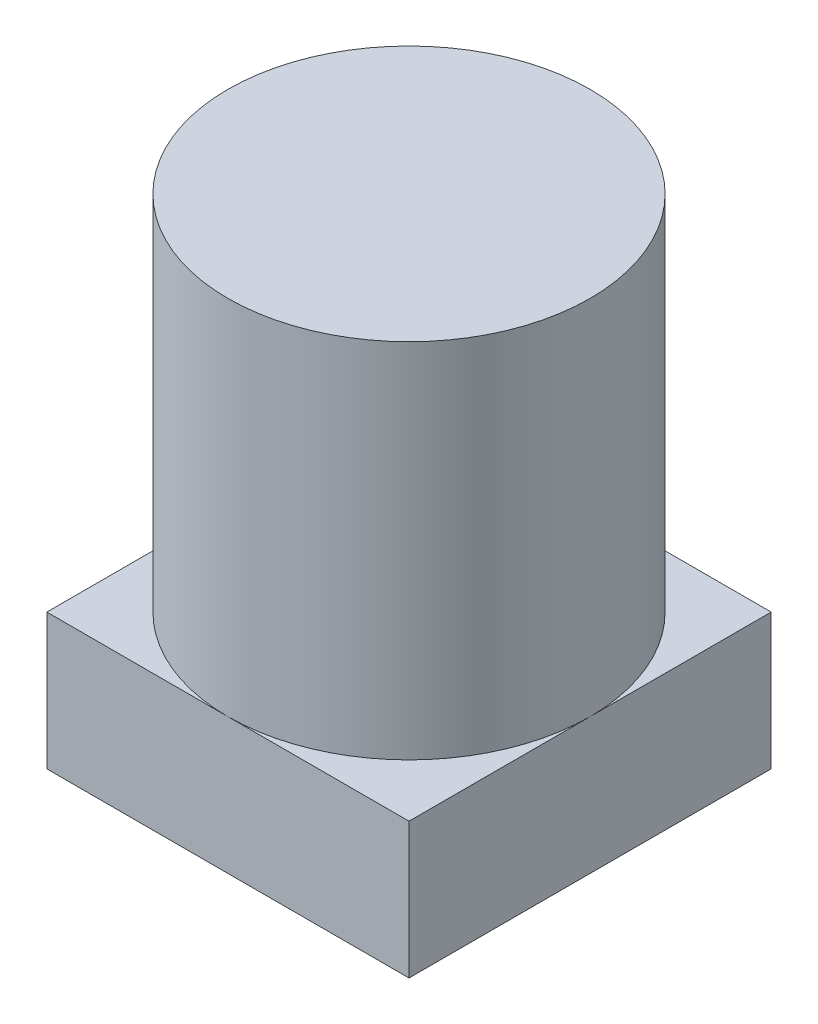
ISO-10303-21;
HEADER;
FILE_DESCRIPTION(('STEP AP214'),'2;1');
FILE_NAME('part.step','',(''),(''),'','','');
FILE_SCHEMA(('AUTOMOTIVE_DESIGN { 1 0 10303 214 1 1 1 1 }'));
ENDSEC;
DATA;
#1=APPLICATION_CONTEXT('core data for automotive mechanical design processes');
#2=APPLICATION_PROTOCOL_DEFINITION('international standard','automotive_design',2000,#1);
#3=PRODUCT_CONTEXT('',#1,'mechanical');
#4=PRODUCT('Part','Part','',(#3));
#5=PRODUCT_RELATED_PRODUCT_CATEGORY('part','',(#4));
#6=PRODUCT_DEFINITION_FORMATION('','',#4);
#7=PRODUCT_DEFINITION_CONTEXT('part definition',#1,'design');
#8=PRODUCT_DEFINITION('design','',#6,#7);
#9=PRODUCT_DEFINITION_SHAPE('','',#8);
#10=(LENGTH_UNIT() NAMED_UNIT(*) SI_UNIT(.MILLI.,.METRE.));
#11=(NAMED_UNIT(*) PLANE_ANGLE_UNIT() SI_UNIT($,.RADIAN.));
#12=(NAMED_UNIT(*) SI_UNIT($,.STERADIAN.) SOLID_ANGLE_UNIT());
#13=UNCERTAINTY_MEASURE_WITH_UNIT(LENGTH_MEASURE(1.E-05),#10,'distance_accuracy_value','');
#14=(GEOMETRIC_REPRESENTATION_CONTEXT(3) GLOBAL_UNCERTAINTY_ASSIGNED_CONTEXT((#13)) GLOBAL_UNIT_ASSIGNED_CONTEXT((#10,
#11,#12)) REPRESENTATION_CONTEXT('',''));
#15=CARTESIAN_POINT('',(0.,0.,0.));
#16=DIRECTION('',(0.,0.,1.));
#17=DIRECTION('',(1.,0.,0.));
#18=AXIS2_PLACEMENT_3D('',#15,#16,#17);
#19=CARTESIAN_POINT('',(0.,3.,0.));
#20=DIRECTION('',(0.,1.,0.));
#21=DIRECTION('',(0.,0.,1.));
#22=AXIS2_PLACEMENT_3D('',#19,#20,#21);
#23=PLANE('',#22);
#24=CARTESIAN_POINT('',(1.30973451327434,3.,1.46902654867257));
#25=DIRECTION('',(0.,1.,0.));
#26=DIRECTION('',(0.,0.,1.));
#27=AXIS2_PLACEMENT_3D('',#24,#25,#26);
#28=CIRCLE('',#27,4.);
#29=CARTESIAN_POINT('',(1.30973451327434,3.,5.46902654867257));
#30=VERTEX_POINT('',#29);
#31=CARTESIAN_POINT('',(5.30973451327434,3.,1.46902654867257));
#32=VERTEX_POINT('',#31);
#33=EDGE_CURVE('E44',#30,#32,#28,.T.);
#34=ORIENTED_EDGE('',*,*,#33,.F.);
#35=DIRECTION('',(1.,0.,0.));
#36=VECTOR('',#35,1.);
#37=CARTESIAN_POINT('',(-2.69026548672566,3.,5.46902654867257));
#38=LINE('',#37,#36);
#39=CARTESIAN_POINT('',(5.30973451327434,3.,5.46902654867257));
#40=VERTEX_POINT('',#39);
#41=EDGE_CURVE('E98',#30,#40,#38,.T.);
#42=ORIENTED_EDGE('',*,*,#41,.T.);
#43=DIRECTION('',(0.,0.,-1.));
#44=VECTOR('',#43,1.);
#45=CARTESIAN_POINT('',(5.30973451327434,3.,-2.53097345132743));
#46=LINE('',#45,#44);
#47=EDGE_CURVE('E110',#40,#32,#46,.T.);
#48=ORIENTED_EDGE('',*,*,#47,.T.);
#49=EDGE_LOOP('',(#34,#42,#48));
#50=FACE_BOUND('',#49,.T.);
#51=ADVANCED_FACE('F33',(#50),#23,.T.);
#52=CARTESIAN_POINT('',(1.30973451327434,3.,-2.53097345132743));
#53=VERTEX_POINT('',#52);
#54=EDGE_CURVE('E11',#32,#53,#28,.T.);
#55=ORIENTED_EDGE('',*,*,#54,.F.);
#56=CARTESIAN_POINT('',(5.30973451327434,3.,-2.53097345132743));
#57=VERTEX_POINT('',#56);
#58=EDGE_CURVE('E97',#32,#57,#46,.T.);
#59=ORIENTED_EDGE('',*,*,#58,.T.);
#60=DIRECTION('',(-1.,0.,0.));
#61=VECTOR('',#60,1.);
#62=CARTESIAN_POINT('',(-2.69026548672566,3.,-2.53097345132743));
#63=LINE('',#62,#61);
#64=EDGE_CURVE('E119',#57,#53,#63,.T.);
#65=ORIENTED_EDGE('',*,*,#64,.T.);
#66=EDGE_LOOP('',(#55,#59,#65));
#67=FACE_BOUND('',#66,.T.);
#68=ADVANCED_FACE('F150',(#67),#23,.T.);
#69=CARTESIAN_POINT('',(-2.69026548672566,3.,1.46902654867257));
#70=VERTEX_POINT('',#69);
#71=EDGE_CURVE('E42',#53,#70,#28,.T.);
#72=ORIENTED_EDGE('',*,*,#71,.F.);
#73=CARTESIAN_POINT('',(-2.69026548672566,3.,-2.53097345132743));
#74=VERTEX_POINT('',#73);
#75=EDGE_CURVE('E118',#53,#74,#63,.T.);
#76=ORIENTED_EDGE('',*,*,#75,.T.);
#77=DIRECTION('',(0.,0.,1.));
#78=VECTOR('',#77,1.);
#79=CARTESIAN_POINT('',(-2.69026548672566,3.,-2.53097345132743));
#80=LINE('',#79,#78);
#81=EDGE_CURVE('E108',#74,#70,#80,.T.);
#82=ORIENTED_EDGE('',*,*,#81,.T.);
#83=EDGE_LOOP('',(#72,#76,#82));
#84=FACE_BOUND('',#83,.T.);
#85=ADVANCED_FACE('F149',(#84),#23,.T.);
#86=CARTESIAN_POINT('',(-2.69026548672566,3.,-2.53097345132743));
#87=DIRECTION('',(1.,0.,0.));
#88=DIRECTION('',(0.,0.,-1.));
#89=AXIS2_PLACEMENT_3D('',#86,#87,#88);
#90=PLANE('',#89);
#91=DIRECTION('',(0.,0.,1.));
#92=VECTOR('',#91,1.);
#93=CARTESIAN_POINT('',(-2.69026548672566,0.,-2.53097345132743));
#94=LINE('',#93,#92);
#95=CARTESIAN_POINT('',(-2.69026548672566,0.,-2.53097345132743));
#96=VERTEX_POINT('',#95);
#97=CARTESIAN_POINT('',(-2.69026548672566,0.,5.46902654867257));
#98=VERTEX_POINT('',#97);
#99=EDGE_CURVE('E122',#96,#98,#94,.T.);
#100=ORIENTED_EDGE('',*,*,#99,.T.);
#101=DIRECTION('',(0.,-1.,0.));
#102=VECTOR('',#101,1.);
#103=CARTESIAN_POINT('',(-2.69026548672566,3.,5.46902654867257));
#104=LINE('',#103,#102);
#105=CARTESIAN_POINT('',(-2.69026548672566,3.,5.46902654867257));
#106=VERTEX_POINT('',#105);
#107=EDGE_CURVE('E37',#106,#98,#104,.T.);
#108=ORIENTED_EDGE('',*,*,#107,.F.);
#109=EDGE_CURVE('E93',#70,#106,#80,.T.);
#110=ORIENTED_EDGE('',*,*,#109,.F.);
#111=ORIENTED_EDGE('',*,*,#81,.F.);
#112=DIRECTION('',(0.,-1.,0.));
#113=VECTOR('',#112,1.);
#114=CARTESIAN_POINT('',(-2.69026548672566,3.,-2.53097345132743));
#115=LINE('',#114,#113);
#116=EDGE_CURVE('E121',#74,#96,#115,.T.);
#117=ORIENTED_EDGE('',*,*,#116,.T.);
#118=EDGE_LOOP('',(#100,#108,#110,#111,#117));
#119=FACE_BOUND('',#118,.T.);
#120=ADVANCED_FACE('F35',(#119),#90,.F.);
#121=CARTESIAN_POINT('',(-2.69026548672566,3.,5.46902654867257));
#122=DIRECTION('',(0.,0.,-1.));
#123=DIRECTION('',(-1.,0.,0.));
#124=AXIS2_PLACEMENT_3D('',#121,#122,#123);
#125=PLANE('',#124);
#126=DIRECTION('',(1.,0.,0.));
#127=VECTOR('',#126,1.);
#128=CARTESIAN_POINT('',(-2.69026548672566,0.,5.46902654867257));
#129=LINE('',#128,#127);
#130=CARTESIAN_POINT('',(5.30973451327434,0.,5.46902654867257));
#131=VERTEX_POINT('',#130);
#132=EDGE_CURVE('E125',#98,#131,#129,.T.);
#133=ORIENTED_EDGE('',*,*,#132,.T.);
#134=DIRECTION('',(0.,-1.,0.));
#135=VECTOR('',#134,1.);
#136=CARTESIAN_POINT('',(5.30973451327434,3.,5.46902654867257));
#137=LINE('',#136,#135);
#138=EDGE_CURVE('E104',#40,#131,#137,.T.);
#139=ORIENTED_EDGE('',*,*,#138,.F.);
#140=ORIENTED_EDGE('',*,*,#41,.F.);
#141=EDGE_CURVE('E87',#106,#30,#38,.T.);
#142=ORIENTED_EDGE('',*,*,#141,.F.);
#143=ORIENTED_EDGE('',*,*,#107,.T.);
#144=EDGE_LOOP('',(#133,#139,#140,#142,#143));
#145=FACE_BOUND('',#144,.T.);
#146=ADVANCED_FACE('F102',(#145),#125,.F.);
#147=CARTESIAN_POINT('',(5.30973451327434,3.,-2.53097345132743));
#148=DIRECTION('',(-1.,0.,0.));
#149=DIRECTION('',(0.,0.,1.));
#150=AXIS2_PLACEMENT_3D('',#147,#148,#149);
#151=PLANE('',#150);
#152=DIRECTION('',(0.,0.,-1.));
#153=VECTOR('',#152,1.);
#154=CARTESIAN_POINT('',(5.30973451327434,0.,-2.53097345132743));
#155=LINE('',#154,#153);
#156=CARTESIAN_POINT('',(5.30973451327434,0.,-2.53097345132743));
#157=VERTEX_POINT('',#156);
#158=EDGE_CURVE('E127',#131,#157,#155,.T.);
#159=ORIENTED_EDGE('',*,*,#158,.T.);
#160=DIRECTION('',(0.,-1.,0.));
#161=VECTOR('',#160,1.);
#162=CARTESIAN_POINT('',(5.30973451327434,3.,-2.53097345132743));
#163=LINE('',#162,#161);
#164=EDGE_CURVE('E133',#57,#157,#163,.T.);
#165=ORIENTED_EDGE('',*,*,#164,.F.);
#166=ORIENTED_EDGE('',*,*,#58,.F.);
#167=ORIENTED_EDGE('',*,*,#47,.F.);
#168=ORIENTED_EDGE('',*,*,#138,.T.);
#169=EDGE_LOOP('',(#159,#165,#166,#167,#168));
#170=FACE_BOUND('',#169,.T.);
#171=ADVANCED_FACE('F137',(#170),#151,.F.);
#172=CARTESIAN_POINT('',(-2.69026548672566,3.,-2.53097345132743));
#173=DIRECTION('',(0.,0.,1.));
#174=DIRECTION('',(1.,0.,0.));
#175=AXIS2_PLACEMENT_3D('',#172,#173,#174);
#176=PLANE('',#175);
#177=DIRECTION('',(-1.,0.,0.));
#178=VECTOR('',#177,1.);
#179=CARTESIAN_POINT('',(-2.69026548672566,0.,-2.53097345132743));
#180=LINE('',#179,#178);
#181=EDGE_CURVE('E129',#157,#96,#180,.T.);
#182=ORIENTED_EDGE('',*,*,#181,.T.);
#183=ORIENTED_EDGE('',*,*,#116,.F.);
#184=ORIENTED_EDGE('',*,*,#75,.F.);
#185=ORIENTED_EDGE('',*,*,#64,.F.);
#186=ORIENTED_EDGE('',*,*,#164,.T.);
#187=EDGE_LOOP('',(#182,#183,#184,#185,#186));
#188=FACE_BOUND('',#187,.T.);
#189=ADVANCED_FACE('F145',(#188),#176,.F.);
#190=EDGE_CURVE('E91',#70,#30,#28,.T.);
#191=ORIENTED_EDGE('',*,*,#190,.F.);
#192=ORIENTED_EDGE('',*,*,#109,.T.);
#193=ORIENTED_EDGE('',*,*,#141,.T.);
#194=EDGE_LOOP('',(#191,#192,#193));
#195=FACE_BOUND('',#194,.T.);
#196=ADVANCED_FACE('F89',(#195),#23,.T.);
#197=CARTESIAN_POINT('',(0.,0.,0.));
#198=DIRECTION('',(0.,1.,0.));
#199=DIRECTION('',(0.,0.,1.));
#200=AXIS2_PLACEMENT_3D('',#197,#198,#199);
#201=PLANE('',#200);
#202=ORIENTED_EDGE('',*,*,#99,.F.);
#203=ORIENTED_EDGE('',*,*,#181,.F.);
#204=ORIENTED_EDGE('',*,*,#158,.F.);
#205=ORIENTED_EDGE('',*,*,#132,.F.);
#206=EDGE_LOOP('',(#202,#203,#204,#205));
#207=FACE_BOUND('',#206,.T.);
#208=ADVANCED_FACE('F142',(#207),#201,.F.);
#209=CARTESIAN_POINT('',(1.30973451327434,11.,1.46902654867257));
#210=DIRECTION('',(0.,-1.,0.));
#211=DIRECTION('',(0.,0.,-1.));
#212=AXIS2_PLACEMENT_3D('',#209,#210,#211);
#213=CYLINDRICAL_SURFACE('',#212,4.);
#214=CARTESIAN_POINT('',(1.30973451327434,11.,1.46902654867257));
#215=DIRECTION('',(0.,1.,0.));
#216=DIRECTION('',(0.,0.,1.));
#217=AXIS2_PLACEMENT_3D('',#214,#215,#216);
#218=CIRCLE('',#217,4.);
#219=CARTESIAN_POINT('',(1.30973451327434,11.,5.46902654867257));
#220=VERTEX_POINT('',#219);
#221=EDGE_CURVE('E112',#220,#220,#218,.T.);
#222=ORIENTED_EDGE('',*,*,#221,.F.);
#223=EDGE_LOOP('',(#222));
#224=FACE_BOUND('',#223,.T.);
#225=ORIENTED_EDGE('',*,*,#33,.T.);
#226=ORIENTED_EDGE('',*,*,#54,.T.);
#227=ORIENTED_EDGE('',*,*,#71,.T.);
#228=ORIENTED_EDGE('',*,*,#190,.T.);
#229=EDGE_LOOP('',(#225,#226,#227,#228));
#230=FACE_BOUND('',#229,.T.);
#231=ADVANCED_FACE('F113',(#224,#230),#213,.T.);
#232=CARTESIAN_POINT('',(1.30973451327434,11.,1.46902654867257));
#233=DIRECTION('',(0.,1.,0.));
#234=DIRECTION('',(0.,0.,1.));
#235=AXIS2_PLACEMENT_3D('',#232,#233,#234);
#236=PLANE('',#235);
#237=ORIENTED_EDGE('',*,*,#221,.T.);
#238=EDGE_LOOP('',(#237));
#239=FACE_BOUND('',#238,.T.);
#240=ADVANCED_FACE('F204',(#239),#236,.T.);
#241=CLOSED_SHELL('',(#51,#68,#85,#120,#146,#171,#189,#196,#208,#231,#240));
#242=MANIFOLD_SOLID_BREP('B2',#241);
#243=ADVANCED_BREP_SHAPE_REPRESENTATION('',(#18,#242),#14);
#244=SHAPE_DEFINITION_REPRESENTATION(#9,#243);
ENDSEC;
END-ISO-10303-21;
